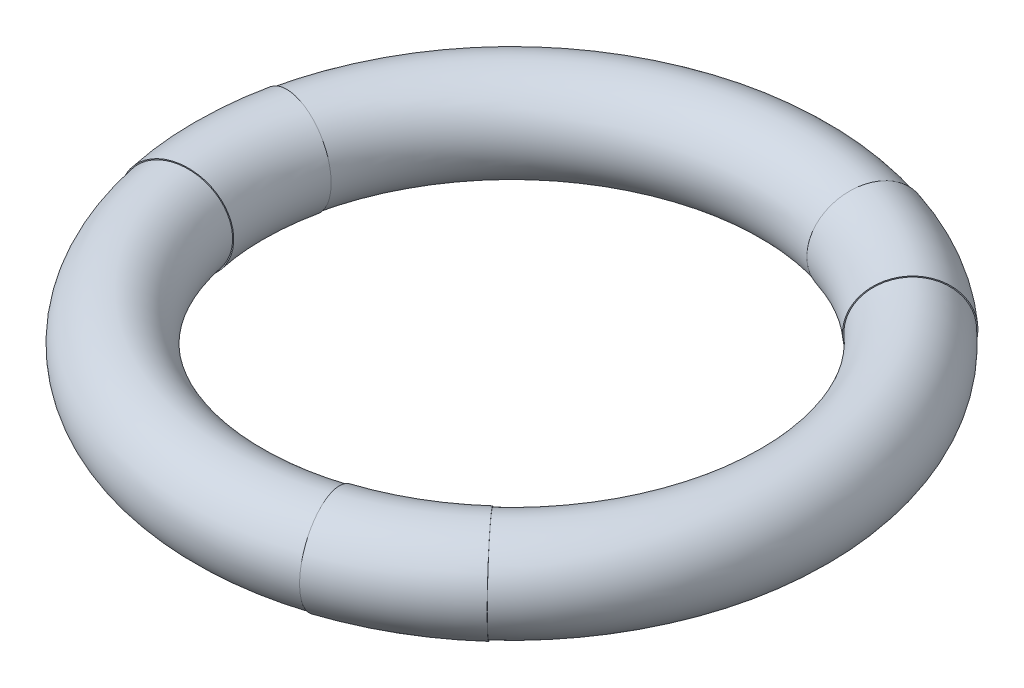
ISO-10303-21;
HEADER;
FILE_DESCRIPTION(('STEP AP214'),'2;1');
FILE_NAME('part.step','',(''),(''),'','','');
FILE_SCHEMA(('AUTOMOTIVE_DESIGN { 1 0 10303 214 1 1 1 1 }'));
ENDSEC;
DATA;
#1=APPLICATION_CONTEXT('core data for automotive mechanical design processes');
#2=APPLICATION_PROTOCOL_DEFINITION('international standard','automotive_design',2000,#1);
#3=PRODUCT_CONTEXT('',#1,'mechanical');
#4=PRODUCT('Part','Part','',(#3));
#5=PRODUCT_RELATED_PRODUCT_CATEGORY('part','',(#4));
#6=PRODUCT_DEFINITION_FORMATION('','',#4);
#7=PRODUCT_DEFINITION_CONTEXT('part definition',#1,'design');
#8=PRODUCT_DEFINITION('design','',#6,#7);
#9=PRODUCT_DEFINITION_SHAPE('','',#8);
#10=(LENGTH_UNIT() NAMED_UNIT(*) SI_UNIT(.MILLI.,.METRE.));
#11=(NAMED_UNIT(*) PLANE_ANGLE_UNIT() SI_UNIT($,.RADIAN.));
#12=(NAMED_UNIT(*) SI_UNIT($,.STERADIAN.) SOLID_ANGLE_UNIT());
#13=UNCERTAINTY_MEASURE_WITH_UNIT(LENGTH_MEASURE(1.E-05),#10,'distance_accuracy_value','');
#14=(GEOMETRIC_REPRESENTATION_CONTEXT(3) GLOBAL_UNCERTAINTY_ASSIGNED_CONTEXT((#13)) GLOBAL_UNIT_ASSIGNED_CONTEXT((#10,
#11,#12)) REPRESENTATION_CONTEXT('',''));
#15=CARTESIAN_POINT('',(0.,0.,0.));
#16=DIRECTION('',(0.,0.,1.));
#17=DIRECTION('',(1.,0.,0.));
#18=AXIS2_PLACEMENT_3D('',#15,#16,#17);
#19=CARTESIAN_POINT('',(0.,0.,0.));
#20=DIRECTION('',(0.,-1.,0.));
#21=DIRECTION('',(0.,0.,-1.));
#22=AXIS2_PLACEMENT_3D('',#19,#20,#21);
#23=TOROIDAL_SURFACE('',#22,152.4,25.4);
#24=CARTESIAN_POINT('',(47.0941899427406,0.,144.941013083382));
#25=DIRECTION('',(0.951056516295157,0.,-0.309016994374938));
#26=DIRECTION('',(-0.309016994374938,0.,-0.951056516295157));
#27=AXIS2_PLACEMENT_3D('',#24,#25,#26);
#28=CIRCLE('',#27,25.4);
#29=CARTESIAN_POINT('',(54.943221599864,0.,169.097848597279));
#30=VERTEX_POINT('',#29);
#31=EDGE_CURVE('E40',#30,#30,#28,.F.);
#32=CARTESIAN_POINT('',(-149.069694351832,0.,31.6857416806266));
#33=DIRECTION('',(0.20791169081776,0.,0.978147600733806));
#34=DIRECTION('',(0.978147600733806,0.,-0.20791169081776));
#35=AXIS2_PLACEMENT_3D('',#32,#33,#34);
#36=CIRCLE('',#35,25.4);
#37=CARTESIAN_POINT('',(-173.914643410471,0.,36.9666986273977));
#38=VERTEX_POINT('',#37);
#39=EDGE_CURVE('E48',#38,#38,#36,.F.);
#40=CARTESIAN_POINT('',(0.,0.,0.));
#41=DIRECTION('',(0.,-1.,0.));
#42=DIRECTION('',(0.,0.,-1.));
#43=AXIS2_PLACEMENT_3D('',#40,#41,#42);
#44=CIRCLE('',#43,177.8);
#45=EDGE_CURVE('',#30,#38,#44,.T.);
#46=ORIENTED_EDGE('',*,*,#31,.T.);
#47=ORIENTED_EDGE('',*,*,#39,.F.);
#48=ORIENTED_EDGE('',*,*,#45,.T.);
#49=ORIENTED_EDGE('',*,*,#45,.F.);
#50=EDGE_LOOP('',(#46,#48,#47,#49));
#51=FACE_BOUND('',#50,.T.);
#52=ADVANCED_FACE('F36',(#51),#23,.T.);
#53=CARTESIAN_POINT('',(101.975504409091,0.,-113.255271402754));
#54=DIRECTION('',(-0.743144825477391,0.,-0.669130606358862));
#55=DIRECTION('',(-0.669130606358862,0.,0.743144825477391));
#56=AXIS2_PLACEMENT_3D('',#53,#54,#55);
#57=CIRCLE('',#56,25.4);
#58=CARTESIAN_POINT('',(118.971421810606,0.,-132.13114996988));
#59=VERTEX_POINT('',#58);
#60=EDGE_CURVE('E51',#59,#59,#57,.F.);
#61=CARTESIAN_POINT('',(101.975504409089,0.,113.255271402756));
#62=DIRECTION('',(0.7431448254774,0.,-0.669130606358852));
#63=DIRECTION('',(-0.669130606358852,0.,-0.7431448254774));
#64=AXIS2_PLACEMENT_3D('',#61,#62,#63);
#65=CIRCLE('',#64,25.4);
#66=CARTESIAN_POINT('',(118.971421810604,0.,132.131149969882));
#67=VERTEX_POINT('',#66);
#68=EDGE_CURVE('E10',#67,#67,#65,.F.);
#69=CARTESIAN_POINT('',(0.,0.,0.));
#70=DIRECTION('',(0.,-1.,0.));
#71=DIRECTION('',(0.,0.,-1.));
#72=AXIS2_PLACEMENT_3D('',#69,#70,#71);
#73=CIRCLE('',#72,177.8);
#74=EDGE_CURVE('',#59,#67,#73,.T.);
#75=ORIENTED_EDGE('',*,*,#60,.T.);
#76=ORIENTED_EDGE('',*,*,#68,.F.);
#77=ORIENTED_EDGE('',*,*,#74,.T.);
#78=ORIENTED_EDGE('',*,*,#74,.F.);
#79=EDGE_LOOP('',(#75,#77,#76,#78));
#80=FACE_BOUND('',#79,.T.);
#81=ADVANCED_FACE('F96',(#80),#23,.T.);
#82=CARTESIAN_POINT('',(-149.069694351832,0.,-31.6857416806266));
#83=DIRECTION('',(-0.20791169081776,0.,0.978147600733806));
#84=DIRECTION('',(0.978147600733806,0.,0.20791169081776));
#85=AXIS2_PLACEMENT_3D('',#82,#83,#84);
#86=CIRCLE('',#85,25.4);
#87=CARTESIAN_POINT('',(-173.914643410471,0.,-36.9666986273977));
#88=VERTEX_POINT('',#87);
#89=EDGE_CURVE('E56',#88,#88,#86,.F.);
#90=CARTESIAN_POINT('',(47.0941899427426,0.,-144.941013083381));
#91=DIRECTION('',(-0.951056516295153,0.,-0.309016994374951));
#92=DIRECTION('',(-0.309016994374951,0.,0.951056516295152));
#93=AXIS2_PLACEMENT_3D('',#90,#91,#92);
#94=CIRCLE('',#93,25.4);
#95=CARTESIAN_POINT('',(54.9432215998664,0.,-169.097848597278));
#96=VERTEX_POINT('',#95);
#97=EDGE_CURVE('E44',#96,#96,#94,.F.);
#98=CARTESIAN_POINT('',(0.,0.,0.));
#99=DIRECTION('',(0.,-1.,0.));
#100=DIRECTION('',(0.,0.,-1.));
#101=AXIS2_PLACEMENT_3D('',#98,#99,#100);
#102=CIRCLE('',#101,177.8);
#103=EDGE_CURVE('',#88,#96,#102,.T.);
#104=ORIENTED_EDGE('',*,*,#89,.T.);
#105=ORIENTED_EDGE('',*,*,#97,.F.);
#106=ORIENTED_EDGE('',*,*,#103,.T.);
#107=ORIENTED_EDGE('',*,*,#103,.F.);
#108=EDGE_LOOP('',(#104,#106,#105,#107));
#109=FACE_BOUND('',#108,.T.);
#110=ADVANCED_FACE('F38',(#109),#23,.T.);
#111=CARTESIAN_POINT('',(0.,-3.33406324526229E-13,0.));
#112=DIRECTION('',(0.,1.,0.));
#113=DIRECTION('',(-1.,0.,0.));
#114=AXIS2_PLACEMENT_3D('',#111,#112,#113);
#115=TOROIDAL_SURFACE('',#114,152.4,25.908);
#116=CARTESIAN_POINT('',(-149.069694351832,0.,-31.6857416806266));
#117=DIRECTION('',(-0.20791169081776,0.,0.978147600733806));
#118=DIRECTION('',(0.978147600733806,0.,0.20791169081776));
#119=AXIS2_PLACEMENT_3D('',#116,#117,#118);
#120=CIRCLE('',#119,25.908);
#121=CARTESIAN_POINT('',(-174.411542391643,0.,-37.0723177663331));
#122=VERTEX_POINT('',#121);
#123=EDGE_CURVE('E59',#122,#122,#120,.T.);
#124=CARTESIAN_POINT('',(-149.069694351832,0.,31.6857416806266));
#125=DIRECTION('',(0.20791169081776,0.,0.978147600733806));
#126=DIRECTION('',(0.978147600733806,0.,-0.20791169081776));
#127=AXIS2_PLACEMENT_3D('',#124,#125,#126);
#128=CIRCLE('',#127,25.908);
#129=CARTESIAN_POINT('',(-174.411542391643,0.,37.0723177663331));
#130=VERTEX_POINT('',#129);
#131=EDGE_CURVE('E53',#130,#130,#128,.T.);
#132=CARTESIAN_POINT('',(0.,-3.33406324526229E-13,0.));
#133=DIRECTION('',(0.,1.,0.));
#134=DIRECTION('',(-1.,0.,0.));
#135=AXIS2_PLACEMENT_3D('',#132,#133,#134);
#136=CIRCLE('',#135,178.308);
#137=EDGE_CURVE('',#122,#130,#136,.T.);
#138=ORIENTED_EDGE('',*,*,#123,.T.);
#139=ORIENTED_EDGE('',*,*,#131,.F.);
#140=ORIENTED_EDGE('',*,*,#137,.T.);
#141=ORIENTED_EDGE('',*,*,#137,.F.);
#142=EDGE_LOOP('',(#138,#140,#139,#141));
#143=FACE_BOUND('',#142,.T.);
#144=ADVANCED_FACE('F105',(#143),#115,.T.);
#145=CARTESIAN_POINT('',(0.,0.,0.));
#146=DIRECTION('',(-0.20791169081776,0.,0.978147600733806));
#147=DIRECTION('',(0.978147600733806,0.,0.20791169081776));
#148=AXIS2_PLACEMENT_3D('',#145,#146,#147);
#149=PLANE('',#148);
#150=ORIENTED_EDGE('',*,*,#89,.F.);
#151=EDGE_LOOP('',(#150));
#152=FACE_BOUND('',#151,.T.);
#153=ORIENTED_EDGE('',*,*,#123,.F.);
#154=EDGE_LOOP('',(#153));
#155=FACE_BOUND('',#154,.T.);
#156=ADVANCED_FACE('F110',(#152,#155),#149,.F.);
#157=CARTESIAN_POINT('',(0.,0.,0.));
#158=DIRECTION('',(0.20791169081776,0.,0.978147600733806));
#159=DIRECTION('',(0.978147600733806,0.,-0.20791169081776));
#160=AXIS2_PLACEMENT_3D('',#157,#158,#159);
#161=PLANE('',#160);
#162=ORIENTED_EDGE('',*,*,#39,.T.);
#163=EDGE_LOOP('',(#162));
#164=FACE_BOUND('',#163,.T.);
#165=ORIENTED_EDGE('',*,*,#131,.T.);
#166=EDGE_LOOP('',(#165));
#167=FACE_BOUND('',#166,.T.);
#168=ADVANCED_FACE('F118',(#164,#167),#161,.T.);
#169=CARTESIAN_POINT('',(0.,-3.33406324526229E-13,0.));
#170=DIRECTION('',(0.,1.,0.));
#171=DIRECTION('',(0.500000000000004,0.,-0.866025403784436));
#172=AXIS2_PLACEMENT_3D('',#169,#170,#171);
#173=TOROIDAL_SURFACE('',#172,152.4,25.908);
#174=CARTESIAN_POINT('',(101.975504409091,-5.55932169085847E-13,-113.255271402754));
#175=DIRECTION('',(-0.743144825477391,0.,-0.669130606358862));
#176=DIRECTION('',(-0.669130606358862,0.,0.743144825477391));
#177=AXIS2_PLACEMENT_3D('',#174,#175,#176);
#178=CIRCLE('',#177,25.908);
#179=CARTESIAN_POINT('',(119.311340158636,-5.93761562660982E-13,-132.508667541223));
#180=VERTEX_POINT('',#179);
#181=EDGE_CURVE('E54',#180,#180,#178,.T.);
#182=CARTESIAN_POINT('',(47.0941899427426,-4.35990242034207E-13,-144.941013083381));
#183=DIRECTION('',(-0.951056516295153,0.,-0.309016994374951));
#184=DIRECTION('',(-0.309016994374951,0.,0.951056516295153));
#185=AXIS2_PLACEMENT_3D('',#182,#183,#184);
#186=CIRCLE('',#185,25.908);
#187=CARTESIAN_POINT('',(55.1002022330088,-4.53429508010563E-13,-169.580985307556));
#188=VERTEX_POINT('',#187);
#189=EDGE_CURVE('E68',#188,#188,#186,.T.);
#190=CARTESIAN_POINT('',(0.,-3.33406324526229E-13,0.));
#191=DIRECTION('',(0.,1.,0.));
#192=DIRECTION('',(0.500000000000004,0.,-0.866025403784436));
#193=AXIS2_PLACEMENT_3D('',#190,#191,#192);
#194=CIRCLE('',#193,178.308);
#195=EDGE_CURVE('',#180,#188,#194,.T.);
#196=ORIENTED_EDGE('',*,*,#181,.T.);
#197=ORIENTED_EDGE('',*,*,#189,.F.);
#198=ORIENTED_EDGE('',*,*,#195,.T.);
#199=ORIENTED_EDGE('',*,*,#195,.F.);
#200=EDGE_LOOP('',(#196,#198,#197,#199));
#201=FACE_BOUND('',#200,.T.);
#202=ADVANCED_FACE('F125',(#201),#173,.T.);
#203=CARTESIAN_POINT('',(0.,0.,0.));
#204=DIRECTION('',(-0.743144825477391,0.,-0.669130606358862));
#205=DIRECTION('',(-0.669130606358862,0.,0.743144825477391));
#206=AXIS2_PLACEMENT_3D('',#203,#204,#205);
#207=PLANE('',#206);
#208=ORIENTED_EDGE('',*,*,#60,.F.);
#209=EDGE_LOOP('',(#208));
#210=FACE_BOUND('',#209,.T.);
#211=ORIENTED_EDGE('',*,*,#181,.F.);
#212=EDGE_LOOP('',(#211));
#213=FACE_BOUND('',#212,.T.);
#214=ADVANCED_FACE('F92',(#210,#213),#207,.F.);
#215=CARTESIAN_POINT('',(0.,0.,0.));
#216=DIRECTION('',(-0.951056516295153,0.,-0.309016994374951));
#217=DIRECTION('',(-0.309016994374951,0.,0.951056516295153));
#218=AXIS2_PLACEMENT_3D('',#215,#216,#217);
#219=PLANE('',#218);
#220=ORIENTED_EDGE('',*,*,#97,.T.);
#221=EDGE_LOOP('',(#220));
#222=FACE_BOUND('',#221,.T.);
#223=ORIENTED_EDGE('',*,*,#189,.T.);
#224=EDGE_LOOP('',(#223));
#225=FACE_BOUND('',#224,.T.);
#226=ADVANCED_FACE('F83',(#222,#225),#219,.T.);
#227=CARTESIAN_POINT('',(0.,-3.33406324526229E-13,0.));
#228=DIRECTION('',(0.,1.,0.));
#229=DIRECTION('',(0.499999999999992,0.,0.866025403784443));
#230=AXIS2_PLACEMENT_3D('',#227,#228,#229);
#231=TOROIDAL_SURFACE('',#230,152.4,25.908);
#232=CARTESIAN_POINT('',(47.0941899427406,-4.35990242034203E-13,144.941013083382));
#233=DIRECTION('',(0.951056516295157,0.,-0.309016994374938));
#234=DIRECTION('',(-0.309016994374938,0.,-0.951056516295157));
#235=AXIS2_PLACEMENT_3D('',#232,#233,#234);
#236=CIRCLE('',#235,25.908);
#237=CARTESIAN_POINT('',(55.1002022330065,-4.53429508010558E-13,169.580985307557));
#238=VERTEX_POINT('',#237);
#239=EDGE_CURVE('E71',#238,#238,#236,.T.);
#240=CARTESIAN_POINT('',(101.975504409089,-5.55932169085844E-13,113.255271402756));
#241=DIRECTION('',(0.7431448254774,0.,-0.669130606358852));
#242=DIRECTION('',(-0.669130606358852,0.,-0.7431448254774));
#243=AXIS2_PLACEMENT_3D('',#240,#241,#242);
#244=CIRCLE('',#243,25.908);
#245=CARTESIAN_POINT('',(119.311340158634,-5.93761562660978E-13,132.508667541224));
#246=VERTEX_POINT('',#245);
#247=EDGE_CURVE('E74',#246,#246,#244,.T.);
#248=CARTESIAN_POINT('',(0.,-3.33406324526229E-13,0.));
#249=DIRECTION('',(0.,1.,0.));
#250=DIRECTION('',(0.499999999999992,0.,0.866025403784443));
#251=AXIS2_PLACEMENT_3D('',#248,#249,#250);
#252=CIRCLE('',#251,178.308);
#253=EDGE_CURVE('',#238,#246,#252,.T.);
#254=ORIENTED_EDGE('',*,*,#239,.T.);
#255=ORIENTED_EDGE('',*,*,#247,.F.);
#256=ORIENTED_EDGE('',*,*,#253,.T.);
#257=ORIENTED_EDGE('',*,*,#253,.F.);
#258=EDGE_LOOP('',(#254,#256,#255,#257));
#259=FACE_BOUND('',#258,.T.);
#260=ADVANCED_FACE('F80',(#259),#231,.T.);
#261=CARTESIAN_POINT('',(0.,0.,0.));
#262=DIRECTION('',(0.951056516295157,0.,-0.309016994374938));
#263=DIRECTION('',(-0.309016994374938,0.,-0.951056516295157));
#264=AXIS2_PLACEMENT_3D('',#261,#262,#263);
#265=PLANE('',#264);
#266=ORIENTED_EDGE('',*,*,#31,.F.);
#267=EDGE_LOOP('',(#266));
#268=FACE_BOUND('',#267,.T.);
#269=ORIENTED_EDGE('',*,*,#239,.F.);
#270=EDGE_LOOP('',(#269));
#271=FACE_BOUND('',#270,.T.);
#272=ADVANCED_FACE('F82',(#268,#271),#265,.F.);
#273=CARTESIAN_POINT('',(0.,0.,0.));
#274=DIRECTION('',(0.7431448254774,0.,-0.669130606358852));
#275=DIRECTION('',(-0.669130606358852,0.,-0.7431448254774));
#276=AXIS2_PLACEMENT_3D('',#273,#274,#275);
#277=PLANE('',#276);
#278=ORIENTED_EDGE('',*,*,#68,.T.);
#279=EDGE_LOOP('',(#278));
#280=FACE_BOUND('',#279,.T.);
#281=ORIENTED_EDGE('',*,*,#247,.T.);
#282=EDGE_LOOP('',(#281));
#283=FACE_BOUND('',#282,.T.);
#284=ADVANCED_FACE('F78',(#280,#283),#277,.T.);
#285=CLOSED_SHELL('',(#52,#81,#110,#144,#156,#168,#202,#214,#226,#260,#272,#284));
#286=MANIFOLD_SOLID_BREP('B2',#285);
#287=ADVANCED_BREP_SHAPE_REPRESENTATION('',(#18,#286),#14);
#288=SHAPE_DEFINITION_REPRESENTATION(#9,#287);
ENDSEC;
END-ISO-10303-21;
